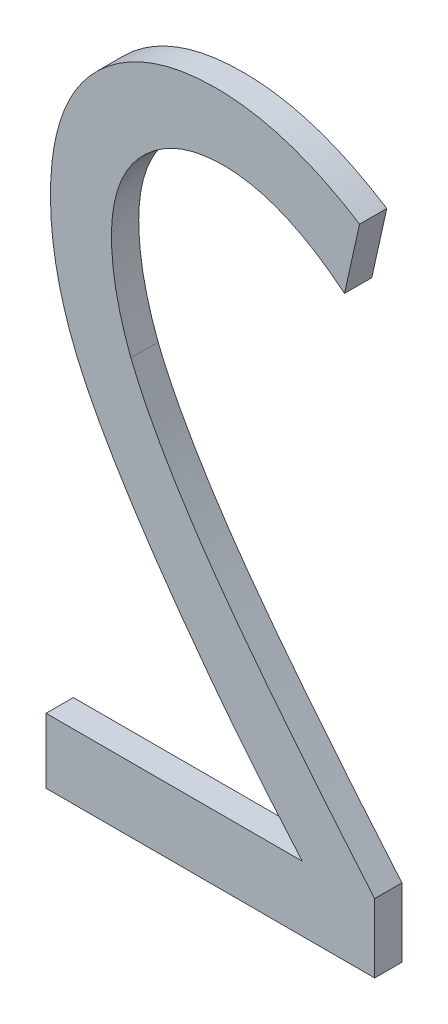
ISO-10303-21;
HEADER;
FILE_DESCRIPTION(('STEP AP214'),'2;1');
FILE_NAME('part.step','',(''),(''),'','','');
FILE_SCHEMA(('AUTOMOTIVE_DESIGN { 1 0 10303 214 1 1 1 1 }'));
ENDSEC;
DATA;
#1=APPLICATION_CONTEXT('core data for automotive mechanical design processes');
#2=APPLICATION_PROTOCOL_DEFINITION('international standard','automotive_design',2000,#1);
#3=PRODUCT_CONTEXT('',#1,'mechanical');
#4=PRODUCT('Part','Part','',(#3));
#5=PRODUCT_RELATED_PRODUCT_CATEGORY('part','',(#4));
#6=PRODUCT_DEFINITION_FORMATION('','',#4);
#7=PRODUCT_DEFINITION_CONTEXT('part definition',#1,'design');
#8=PRODUCT_DEFINITION('design','',#6,#7);
#9=PRODUCT_DEFINITION_SHAPE('','',#8);
#10=(LENGTH_UNIT() NAMED_UNIT(*) SI_UNIT(.MILLI.,.METRE.));
#11=(NAMED_UNIT(*) PLANE_ANGLE_UNIT() SI_UNIT($,.RADIAN.));
#12=(NAMED_UNIT(*) SI_UNIT($,.STERADIAN.) SOLID_ANGLE_UNIT());
#13=UNCERTAINTY_MEASURE_WITH_UNIT(LENGTH_MEASURE(1.E-05),#10,'distance_accuracy_value','');
#14=(GEOMETRIC_REPRESENTATION_CONTEXT(3) GLOBAL_UNCERTAINTY_ASSIGNED_CONTEXT((#13)) GLOBAL_UNIT_ASSIGNED_CONTEXT((#10,
#11,#12)) REPRESENTATION_CONTEXT('',''));
#15=CARTESIAN_POINT('',(0.,0.,0.));
#16=DIRECTION('',(0.,0.,1.));
#17=DIRECTION('',(1.,0.,0.));
#18=AXIS2_PLACEMENT_3D('',#15,#16,#17);
#19=CARTESIAN_POINT('',(179.363036712927,125.948278329335,-39.));
#20=DIRECTION('',(0.,0.,1.));
#21=DIRECTION('',(1.,0.,0.));
#22=AXIS2_PLACEMENT_3D('',#19,#20,#21);
#23=PLANE('',#22);
#24=DIRECTION('',(1.,0.,0.));
#25=VECTOR('',#24,1.);
#26=CARTESIAN_POINT('',(179.363036712927,125.152214694954,-39.));
#27=LINE('',#26,#25);
#28=CARTESIAN_POINT('',(179.715277560368,125.152214694954,-39.));
#29=VERTEX_POINT('',#28);
#30=CARTESIAN_POINT('',(178.775734458008,125.152214694954,-39.));
#31=VERTEX_POINT('',#30);
#32=EDGE_CURVE('E128',#29,#31,#27,.F.);
#33=ORIENTED_EDGE('',*,*,#32,.T.);
#34=DIRECTION('',(0.,1.,0.));
#35=VECTOR('',#34,1.);
#36=CARTESIAN_POINT('',(178.775734458008,125.948278329335,-39.));
#37=LINE('',#36,#35);
#38=CARTESIAN_POINT('',(178.775734458008,124.913993413852,-39.));
#39=VERTEX_POINT('',#38);
#40=EDGE_CURVE('E108',#31,#39,#37,.F.);
#41=ORIENTED_EDGE('',*,*,#40,.T.);
#42=DIRECTION('',(1.,0.,0.));
#43=VECTOR('',#42,1.);
#44=CARTESIAN_POINT('',(179.363036712927,124.913993413852,-39.));
#45=LINE('',#44,#43);
#46=CARTESIAN_POINT('',(179.98083353664,124.913993413852,-39.));
#47=VERTEX_POINT('',#46);
#48=EDGE_CURVE('E104',#39,#47,#45,.T.);
#49=ORIENTED_EDGE('',*,*,#48,.T.);
#50=DIRECTION('',(0.,1.,0.));
#51=VECTOR('',#50,1.);
#52=CARTESIAN_POINT('',(179.98083353664,124.913993413852,-39.));
#53=LINE('',#52,#51);
#54=CARTESIAN_POINT('',(179.98083353664,125.166110936351,-39.));
#55=VERTEX_POINT('',#54);
#56=EDGE_CURVE('E102',#55,#47,#53,.F.);
#57=ORIENTED_EDGE('',*,*,#56,.F.);
#58=CARTESIAN_POINT('',(179.086727768623,126.436624435557,-39.));
#59=CARTESIAN_POINT('',(179.092888818387,126.421132313016,-39.));
#60=CARTESIAN_POINT('',(179.099348113706,126.405762428981,-39.));
#61=CARTESIAN_POINT('',(179.112776282606,126.375247302634,-39.));
#62=CARTESIAN_POINT('',(179.119745130022,126.360102048836,-39.));
#63=CARTESIAN_POINT('',(179.134105901526,126.3300152623,-39.));
#64=CARTESIAN_POINT('',(179.141497811536,126.315073722804,-39.));
#65=CARTESIAN_POINT('',(179.156644408297,126.285376729993,-39.));
#66=CARTESIAN_POINT('',(179.164399086915,126.270621272514,-39.));
#67=CARTESIAN_POINT('',(179.188134300099,126.226603293513,-39.));
#68=CARTESIAN_POINT('',(179.204584155622,126.197592989437,-39.));
#69=CARTESIAN_POINT('',(179.229980422469,126.154512475278,-39.));
#70=CARTESIAN_POINT('',(179.238565365378,126.140225937032,-39.));
#71=CARTESIAN_POINT('',(179.264647660254,126.097562698147,-39.));
#72=CARTESIAN_POINT('',(179.282471336021,126.069384376933,-39.));
#73=CARTESIAN_POINT('',(179.309726506305,126.027460170251,-39.));
#74=CARTESIAN_POINT('',(179.318897777582,126.013543222797,-39.));
#75=CARTESIAN_POINT('',(179.346670097442,125.971961757683,-39.));
#76=CARTESIAN_POINT('',(179.365528629747,125.944468232993,-39.));
#77=CARTESIAN_POINT('',(179.403880050266,125.889930433792,-39.));
#78=CARTESIAN_POINT('',(179.423372922731,125.862886148153,-39.));
#79=CARTESIAN_POINT('',(179.462797418602,125.809121395734,-39.));
#80=CARTESIAN_POINT('',(179.482729032694,125.782400922097,-39.));
#81=CARTESIAN_POINT('',(179.522945512241,125.729228009605,-39.));
#82=CARTESIAN_POINT('',(179.543230373816,125.70277556781,-39.));
#83=CARTESIAN_POINT('',(179.584083147597,125.650090768106,-39.));
#84=CARTESIAN_POINT('',(179.604651058036,125.623858408825,-39.));
#85=CARTESIAN_POINT('',(179.646022863837,125.571580851571,-39.));
#86=CARTESIAN_POINT('',(179.666826758301,125.545535652887,-39.));
#87=CARTESIAN_POINT('',(179.729536989084,125.467638921907,-39.));
#88=CARTESIAN_POINT('',(179.771741239735,125.416027066146,-39.));
#89=CARTESIAN_POINT('',(179.83549269295,125.338980235817,-39.));
#90=CARTESIAN_POINT('',(179.856817134012,125.31336004769,-39.));
#91=CARTESIAN_POINT('',(179.912258549975,125.247101268435,-39.));
#92=CARTESIAN_POINT('',(179.946477494292,125.206547984025,-39.));
#93=CARTESIAN_POINT('',(179.98083353664,125.166110936351,-39.));
#94=B_SPLINE_CURVE_WITH_KNOTS('',3,(#58,#59,#60,#61,#62,#63,#64,#65,#66,#67,#68,#69,#70,#71,#72,
#73,#74,#75,#76,#77,#78,#79,#80,#81,#82,#83,#84,#85,#86,#87,#88,#89,#90,#91,#92,#93),
.UNSPECIFIED.,.F.,.F.,(4,2,2,2,2,2,2,2,2,2,2,2,2,2,2,2,2,4),(0.,0.0500087757287242,
0.100014985312846,0.15001953180807,0.200022957623838,0.300042550380375,0.350044224301037,
0.450054488447363,0.500055433134775,0.600063057038982,0.700068199814345,0.800071221646829,
0.900073145683874,1.00007444573218,1.10007536526152,1.30008029152964,1.40008068587399,
1.55926333786803),.UNSPECIFIED.);
#95=CARTESIAN_POINT('',(179.086727768623,126.436624435557,-39.));
#96=VERTEX_POINT('',#95);
#97=EDGE_CURVE('E24',#96,#55,#94,.T.);
#98=ORIENTED_EDGE('',*,*,#97,.F.);
#99=CARTESIAN_POINT('',(179.870269356405,127.032839364091,-39.));
#100=CARTESIAN_POINT('',(179.844464604507,127.053892125233,-39.));
#101=CARTESIAN_POINT('',(179.817778702732,127.074000949937,-39.));
#102=CARTESIAN_POINT('',(179.76223301318,127.111647626545,-39.));
#103=CARTESIAN_POINT('',(179.733352399875,127.129154494778,-39.));
#104=CARTESIAN_POINT('',(179.673420875205,127.16048662411,-39.));
#105=CARTESIAN_POINT('',(179.642359660831,127.17429268314,-39.));
#106=CARTESIAN_POINT('',(179.578493558742,127.196769154013,-39.));
#107=CARTESIAN_POINT('',(179.545696659129,127.205461184089,-39.));
#108=CARTESIAN_POINT('',(179.499022545459,127.213244571093,-39.));
#109=CARTESIAN_POINT('',(179.485560751104,127.214968783175,-39.));
#110=CARTESIAN_POINT('',(179.458537604108,127.217341189161,-39.));
#111=CARTESIAN_POINT('',(179.444976236531,127.217989218195,-39.));
#112=CARTESIAN_POINT('',(179.417837304214,127.218225631912,-39.));
#113=CARTESIAN_POINT('',(179.404259734666,127.217813431986,-39.));
#114=CARTESIAN_POINT('',(179.377184572427,127.215908870563,-39.));
#115=CARTESIAN_POINT('',(179.363686961864,127.214416760413,-39.));
#116=CARTESIAN_POINT('',(179.328392913601,127.208876445988,-39.));
#117=CARTESIAN_POINT('',(179.306740715869,127.203808940999,-39.));
#118=CARTESIAN_POINT('',(179.264633528884,127.190100637508,-39.));
#119=CARTESIAN_POINT('',(179.244176235518,127.181466993905,-39.));
#120=CARTESIAN_POINT('',(179.205070125526,127.160663213691,-39.));
#121=CARTESIAN_POINT('',(179.186425440672,127.148485238908,-39.));
#122=CARTESIAN_POINT('',(179.160245051793,127.127964627676,-39.));
#123=CARTESIAN_POINT('',(179.151805894205,127.120737580784,-39.));
#124=CARTESIAN_POINT('',(179.1355232211,127.105636316063,-39.));
#125=CARTESIAN_POINT('',(179.127679754215,127.097762045503,-39.));
#126=CARTESIAN_POINT('',(179.112694608627,127.081401713745,-39.));
#127=CARTESIAN_POINT('',(179.105551353495,127.072917105028,-39.));
#128=CARTESIAN_POINT('',(179.092075219275,127.055332912896,-39.));
#129=CARTESIAN_POINT('',(179.085742090355,127.046233520402,-39.));
#130=CARTESIAN_POINT('',(179.068045514759,127.018179588419,-39.));
#131=CARTESIAN_POINT('',(179.057936612147,126.998416641935,-39.));
#132=CARTESIAN_POINT('',(179.039836948045,126.954227978385,-39.));
#133=CARTESIAN_POINT('',(179.03244467416,126.92956239722,-39.));
#134=CARTESIAN_POINT('',(179.021725551154,126.879305951644,-39.));
#135=CARTESIAN_POINT('',(179.018415240848,126.853711752754,-39.));
#136=CARTESIAN_POINT('',(179.015428569213,126.806551172576,-39.));
#137=CARTESIAN_POINT('',(179.015246881135,126.785009869474,-39.));
#138=CARTESIAN_POINT('',(179.016609678626,126.741972564922,-39.));
#139=CARTESIAN_POINT('',(179.018155574674,126.720476614866,-39.));
#140=CARTESIAN_POINT('',(179.022861689933,126.677627307792,-39.));
#141=CARTESIAN_POINT('',(179.026024631793,126.656274252998,-39.));
#142=CARTESIAN_POINT('',(179.033793055478,126.613847555167,-39.));
#143=CARTESIAN_POINT('',(179.038397790889,126.592773773422,-39.));
#144=CARTESIAN_POINT('',(179.049424973154,126.548827276362,-39.));
#145=CARTESIAN_POINT('',(179.055984560891,126.525989308047,-39.));
#146=CARTESIAN_POINT('',(179.070419035425,126.480899623099,-39.));
#147=CARTESIAN_POINT('',(179.078284824098,126.458645005543,-39.));
#148=CARTESIAN_POINT('',(179.086727768623,126.436624435557,-39.));
#149=B_SPLINE_CURVE_WITH_KNOTS('',3,(#99,#100,#101,#102,#103,#104,#105,#106,#107,#108,#109,#110,
#111,#112,#113,#114,#115,#116,#117,#118,#119,#120,#121,#122,#123,#124,#125,#126,#127,#128,#129,
#130,#131,#132,#133,#134,#135,#136,#137,#138,#139,#140,#141,#142,#143,#144,#145,#146,#147,#148),
.UNSPECIFIED.,.F.,.F.,(4,2,2,2,2,2,2,2,2,2,2,2,2,2,2,2,2,2,2,2,2,2,2,2,4),(0.,0.100017091060496,
0.20114331978785,0.302784519930555,0.403992912424035,0.444673257895479,0.485359834993945,
0.526068851491836,0.56676839611547,0.63317996550767,0.699458932732076,0.765885602127951,
0.799188569711322,0.832494253265985,0.865723143215523,0.898941760981254,0.965167907700774,
1.04200009693,1.11914257357676,1.1836822873536,1.24827473282316,1.31297629366081,
1.37764441378542,1.44888237926588,1.51964349919607),.UNSPECIFIED.);
#150=CARTESIAN_POINT('',(179.870269356405,127.032839364091,-39.));
#151=VERTEX_POINT('',#150);
#152=EDGE_CURVE('E89',#151,#96,#149,.T.);
#153=ORIENTED_EDGE('',*,*,#152,.F.);
#154=DIRECTION('',(0.217054100601005,0.976159575792959,0.));
#155=VECTOR('',#154,1.);
#156=CARTESIAN_POINT('',(179.870269356405,127.032839364091,-39.));
#157=LINE('',#156,#155);
#158=CARTESIAN_POINT('',(179.925299016887,127.280324806124,-39.));
#159=VERTEX_POINT('',#158);
#160=EDGE_CURVE('E125',#159,#151,#157,.F.);
#161=ORIENTED_EDGE('',*,*,#160,.F.);
#162=CARTESIAN_POINT('',(179.715277560368,125.152214694954,-39.));
#163=CARTESIAN_POINT('',(179.693397723106,125.177352437158,-39.));
#164=CARTESIAN_POINT('',(179.671644203359,125.202599393354,-39.));
#165=CARTESIAN_POINT('',(179.628403526617,125.253346808572,-39.));
#166=CARTESIAN_POINT('',(179.606916539625,125.278847412402,-39.));
#167=CARTESIAN_POINT('',(179.542831864208,125.355837055005,-39.));
#168=CARTESIAN_POINT('',(179.500696735449,125.407715208436,-39.));
#169=CARTESIAN_POINT('',(179.41810739078,125.512802634338,-39.));
#170=CARTESIAN_POINT('',(179.377653432099,125.566012108527,-39.));
#171=CARTESIAN_POINT('',(179.297966316515,125.673272051005,-39.));
#172=CARTESIAN_POINT('',(179.25873226028,125.727321853466,-39.));
#173=CARTESIAN_POINT('',(179.181931718363,125.836590482849,-39.));
#174=CARTESIAN_POINT('',(179.144364948199,125.891809107946,-39.));
#175=CARTESIAN_POINT('',(179.082012780656,125.987709087949,-39.));
#176=CARTESIAN_POINT('',(179.056653266519,126.02801472736,-39.));
#177=CARTESIAN_POINT('',(179.019826459179,126.089258759104,-39.));
#178=CARTESIAN_POINT('',(179.007741368962,126.109825488198,-39.));
#179=CARTESIAN_POINT('',(178.984066433683,126.151254066613,-39.));
#180=CARTESIAN_POINT('',(178.972476784785,126.172116028556,-39.));
#181=CARTESIAN_POINT('',(178.950864946989,126.212411939061,-39.));
#182=CARTESIAN_POINT('',(178.940792798842,126.231819018601,-39.));
#183=CARTESIAN_POINT('',(178.921287097288,126.270952836367,-39.));
#184=CARTESIAN_POINT('',(178.911853517632,126.290679561414,-39.));
#185=CARTESIAN_POINT('',(178.893864510446,126.330528332224,-39.));
#186=CARTESIAN_POINT('',(178.8853088888,126.350650289425,-39.));
#187=CARTESIAN_POINT('',(178.869214406658,126.391295204578,-39.));
#188=CARTESIAN_POINT('',(178.861675551838,126.411818164769,-39.));
#189=CARTESIAN_POINT('',(178.840703993007,126.473796303652,-39.));
#190=CARTESIAN_POINT('',(178.828851395187,126.515802675121,-39.));
#191=CARTESIAN_POINT('',(178.809880166121,126.600863530484,-39.));
#192=CARTESIAN_POINT('',(178.802760051099,126.643917681475,-39.));
#193=CARTESIAN_POINT('',(178.793236974023,126.733481552714,-39.));
#194=CARTESIAN_POINT('',(178.791184753638,126.78002840288,-39.));
#195=CARTESIAN_POINT('',(178.793004369259,126.87310226004,-39.));
#196=CARTESIAN_POINT('',(178.796879334006,126.919629243576,-39.));
#197=CARTESIAN_POINT('',(178.81060289395,126.999095193341,-39.));
#198=CARTESIAN_POINT('',(178.818577264796,127.032341061517,-39.));
#199=CARTESIAN_POINT('',(178.839695079947,127.097086364679,-39.));
#200=CARTESIAN_POINT('',(178.852821676671,127.12859111382,-39.));
#201=CARTESIAN_POINT('',(178.884949702838,127.188983979123,-39.));
#202=CARTESIAN_POINT('',(178.904014471155,127.217839319992,-39.));
#203=CARTESIAN_POINT('',(178.936660650627,127.257792320831,-39.));
#204=CARTESIAN_POINT('',(178.948235954143,127.270570001374,-39.));
#205=CARTESIAN_POINT('',(178.972600579301,127.294911409495,-39.));
#206=CARTESIAN_POINT('',(178.98539013326,127.306474903873,-39.));
#207=CARTESIAN_POINT('',(179.021472764108,127.336203641336,-39.));
#208=CARTESIAN_POINT('',(179.045750909204,127.353194685371,-39.));
#209=CARTESIAN_POINT('',(179.096746112654,127.382992521343,-39.));
#210=CARTESIAN_POINT('',(179.12346259553,127.39580029733,-39.));
#211=CARTESIAN_POINT('',(179.165430730665,127.412072707861,-39.));
#212=CARTESIAN_POINT('',(179.180105335771,127.417086607056,-39.));
#213=CARTESIAN_POINT('',(179.209785644807,127.425971632875,-39.));
#214=CARTESIAN_POINT('',(179.224791070806,127.429843682218,-39.));
#215=CARTESIAN_POINT('',(179.255059431867,127.436506777138,-39.));
#216=CARTESIAN_POINT('',(179.270322698185,127.439296300942,-39.));
#217=CARTESIAN_POINT('',(179.301005510346,127.443853768477,-39.));
#218=CARTESIAN_POINT('',(179.316425126355,127.445621230833,-39.));
#219=CARTESIAN_POINT('',(179.354776366606,127.448853705655,-39.));
#220=CARTESIAN_POINT('',(179.377755744024,127.449764858281,-39.));
#221=CARTESIAN_POINT('',(179.42370746295,127.449688055442,-39.));
#222=CARTESIAN_POINT('',(179.446679803419,127.448699893226,-39.));
#223=CARTESIAN_POINT('',(179.515461272272,127.442778122788,-39.));
#224=CARTESIAN_POINT('',(179.561038259221,127.434879051073,-39.));
#225=CARTESIAN_POINT('',(179.662738603863,127.409022693598,-39.));
#226=CARTESIAN_POINT('',(179.718297906114,127.388889899008,-39.));
#227=CARTESIAN_POINT('',(179.798412540581,127.352364040463,-39.));
#228=CARTESIAN_POINT('',(179.824519410935,127.339174678222,-39.));
#229=CARTESIAN_POINT('',(179.875676499252,127.311014787855,-39.));
#230=CARTESIAN_POINT('',(179.900729094949,127.296048594945,-39.));
#231=CARTESIAN_POINT('',(179.925299016887,127.280324806124,-39.));
#232=B_SPLINE_CURVE_WITH_KNOTS('',3,(#162,#163,#164,#165,#166,#167,#168,#169,#170,#171,#172,
#173,#174,#175,#176,#177,#178,#179,#180,#181,#182,#183,#184,#185,#186,#187,#188,#189,#190,#191,
#192,#193,#194,#195,#196,#197,#198,#199,#200,#201,#202,#203,#204,#205,#206,#207,#208,#209,#210,
#211,#212,#213,#214,#215,#216,#217,#218,#219,#220,#221,#222,#223,#224,#225,#226,#227,#228,#229,
#230,#231),.UNSPECIFIED.,.F.,.F.,(4,2,2,2,2,2,2,2,2,2,2,2,2,2,2,2,2,2,2,2,2,2,2,2,2,2,2,2,2,2,2,
2,2,2,4),(0.,0.0999767718294698,0.200014333832938,0.400482694365106,0.600981615675574,
0.801329041651482,1.00164215072499,1.14446996126362,1.21602823502701,1.28761458405416,
1.35320079741041,1.41878431310224,1.48435329691105,1.54992264675621,1.68059526903083,
1.81122690217361,1.95067370479288,2.09019414161808,2.19241019688116,2.29429475748367,
2.39730559425314,2.44895088202891,2.50060607088424,2.58910563433554,2.677584364565,
2.72406792285531,2.77051381463421,2.81702476375678,2.86355760104136,2.93246017383218,
3.00137024746995,3.13947724549415,3.31572993405268,3.403423555846,3.4909074523921),.UNSPECIFIED.);
#233=EDGE_CURVE('E173',#29,#159,#232,.T.);
#234=ORIENTED_EDGE('',*,*,#233,.F.);
#235=EDGE_LOOP('',(#33,#41,#49,#57,#98,#153,#161,#234));
#236=FACE_BOUND('',#235,.T.);
#237=ADVANCED_FACE('F17',(#236),#23,.T.);
#238=CARTESIAN_POINT('',(179.98083353664,124.913993413852,-39.1));
#239=DIRECTION('',(1.,0.,0.));
#240=DIRECTION('',(0.,0.,-1.));
#241=AXIS2_PLACEMENT_3D('',#238,#239,#240);
#242=PLANE('',#241);
#243=DIRECTION('',(0.,1.,0.));
#244=VECTOR('',#243,1.);
#245=CARTESIAN_POINT('',(179.98083353664,125.948278329335,-39.1));
#246=LINE('',#245,#244);
#247=CARTESIAN_POINT('',(179.98083353664,124.913993413852,-39.1));
#248=VERTEX_POINT('',#247);
#249=CARTESIAN_POINT('',(179.98083353664,125.166110936351,-39.1));
#250=VERTEX_POINT('',#249);
#251=EDGE_CURVE('E112',#248,#250,#246,.T.);
#252=ORIENTED_EDGE('',*,*,#251,.T.);
#253=DIRECTION('',(0.,0.,-1.));
#254=VECTOR('',#253,1.);
#255=CARTESIAN_POINT('',(179.98083353664,125.166110936351,-39.05));
#256=LINE('',#255,#254);
#257=EDGE_CURVE('E98',#55,#250,#256,.T.);
#258=ORIENTED_EDGE('',*,*,#257,.F.);
#259=ORIENTED_EDGE('',*,*,#56,.T.);
#260=DIRECTION('',(0.,0.,-1.));
#261=VECTOR('',#260,1.);
#262=CARTESIAN_POINT('',(179.98083353664,124.913993413852,-39.1));
#263=LINE('',#262,#261);
#264=EDGE_CURVE('E117',#248,#47,#263,.F.);
#265=ORIENTED_EDGE('',*,*,#264,.F.);
#266=EDGE_LOOP('',(#252,#258,#259,#265));
#267=FACE_BOUND('',#266,.T.);
#268=ADVANCED_FACE('F111',(#267),#242,.T.);
#269=CARTESIAN_POINT('',(179.98083353664,125.166110936351,-39.1));
#270=CARTESIAN_POINT('',(179.98083353664,125.166110936351,-39.));
#271=CARTESIAN_POINT('',(179.689024878303,125.509546616605,-39.1));
#272=CARTESIAN_POINT('',(179.689024878303,125.509546616605,-39.));
#273=CARTESIAN_POINT('',(179.476479125432,125.780192460967,-39.1));
#274=CARTESIAN_POINT('',(179.476479125432,125.780192460967,-39.));
#275=CARTESIAN_POINT('',(179.222084953364,126.15641099938,-39.1));
#276=CARTESIAN_POINT('',(179.222084953364,126.15641099938,-39.));
#277=CARTESIAN_POINT('',(179.137213695671,126.309573085637,-39.1));
#278=CARTESIAN_POINT('',(179.137213695671,126.309573085637,-39.));
#279=CARTESIAN_POINT('',(179.086727768623,126.436624435557,-39.1));
#280=CARTESIAN_POINT('',(179.086727768623,126.436624435557,-39.));
#281=B_SPLINE_SURFACE_WITH_KNOTS('',3,1,((#269,#270),(#271,#272),(#273,#274),(#275,#276),(#277,
#278),(#279,#280)),.UNSPECIFIED.,.F.,.F.,.F.,(4,2,4),(2,2),(0.,0.525907121177182,1.),(1.,1.1),.UNSPECIFIED.);
#282=CARTESIAN_POINT('',(179.98083353664,125.166110936351,-39.1));
#283=CARTESIAN_POINT('',(179.959250511314,125.191513419227,-39.1));
#284=CARTESIAN_POINT('',(179.937721811115,125.216962250277,-39.1));
#285=CARTESIAN_POINT('',(179.894788236192,125.267964156109,-39.1));
#286=CARTESIAN_POINT('',(179.873383361545,125.293517230956,-39.1));
#287=CARTESIAN_POINT('',(179.841380343857,125.331933634558,-39.1));
#288=CARTESIAN_POINT('',(179.830730065366,125.344753553456,-39.1));
#289=CARTESIAN_POINT('',(179.79883469711,125.38325948921,-39.1));
#290=CARTESIAN_POINT('',(179.777645151503,125.408991593318,-39.1));
#291=CARTESIAN_POINT('',(179.74598815228,125.447693752213,-39.1));
#292=CARTESIAN_POINT('',(179.735457055478,125.460611785303,-39.1));
#293=CARTESIAN_POINT('',(179.714440591627,125.486484993364,-39.1));
#294=CARTESIAN_POINT('',(179.703955224588,125.499440168343,-39.1));
#295=CARTESIAN_POINT('',(179.672572712846,125.538365440216,-39.1));
#296=CARTESIAN_POINT('',(179.651749292444,125.564395119262,-39.1));
#297=CARTESIAN_POINT('',(179.620688447401,125.603577551715,-39.1));
#298=CARTESIAN_POINT('',(179.610363907612,125.616661312678,-39.1));
#299=CARTESIAN_POINT('',(179.589778465579,125.64287884194,-39.1));
#300=CARTESIAN_POINT('',(179.579517563366,125.656012610264,-39.1));
#301=CARTESIAN_POINT('',(179.559065733498,125.682334544677,-39.1));
#302=CARTESIAN_POINT('',(179.548874805887,125.695522710801,-39.1));
#303=CARTESIAN_POINT('',(179.528570426219,125.721958591561,-39.1));
#304=CARTESIAN_POINT('',(179.518456974226,125.735206306246,-39.1));
#305=CARTESIAN_POINT('',(179.498316437431,125.761767281336,-39.1));
#306=CARTESIAN_POINT('',(179.488289352725,125.775080541813,-39.1));
#307=CARTESIAN_POINT('',(179.468332336457,125.801779752349,-39.1));
#308=CARTESIAN_POINT('',(179.458402405038,125.815165702517,-39.1));
#309=CARTESIAN_POINT('',(179.438652594606,125.842018656015,-39.1));
#310=CARTESIAN_POINT('',(179.428832715817,125.855485659511,-39.1));
#311=CARTESIAN_POINT('',(179.409320077132,125.882511554603,-39.1));
#312=CARTESIAN_POINT('',(179.399627317603,125.896070446465,-39.1));
#313=CARTESIAN_POINT('',(179.380386634783,125.923290901017,-39.1));
#314=CARTESIAN_POINT('',(179.370838712104,125.936952464142,-39.1));
#315=CARTESIAN_POINT('',(179.351925357896,125.964401450942,-39.1));
#316=CARTESIAN_POINT('',(179.34255992731,125.978188875267,-39.1));
#317=CARTESIAN_POINT('',(179.32399098499,126.005872234078,-39.1));
#318=CARTESIAN_POINT('',(179.314787472575,126.019768168108,-39.1));
#319=CARTESIAN_POINT('',(179.301111568365,126.040696336037,-39.1));
#320=CARTESIAN_POINT('',(179.296574521913,126.047686393177,-39.1));
#321=CARTESIAN_POINT('',(179.283031531258,126.068701001598,-39.1));
#322=CARTESIAN_POINT('',(179.274093897071,126.082769746585,-39.1));
#323=CARTESIAN_POINT('',(179.260838693298,126.103967088467,-39.1));
#324=CARTESIAN_POINT('',(179.256445534331,126.111048516411,-39.1));
#325=CARTESIAN_POINT('',(179.247712428384,126.125244103805,-39.1));
#326=CARTESIAN_POINT('',(179.243372481441,126.132358263278,-39.1));
#327=CARTESIAN_POINT('',(179.230436523491,126.153752216135,-39.1));
#328=CARTESIAN_POINT('',(179.221924626229,126.168083115382,-39.1));
#329=CARTESIAN_POINT('',(179.209346337459,126.1896892849,-39.1));
#330=CARTESIAN_POINT('',(179.205185214894,126.196909559856,-39.1));
#331=CARTESIAN_POINT('',(179.196930123114,126.211388474837,-39.1));
#332=CARTESIAN_POINT('',(179.19283615398,126.218647114908,-39.1));
#333=CARTESIAN_POINT('',(179.184719898578,126.233204308702,-39.1));
#334=CARTESIAN_POINT('',(179.18069761241,126.24050286248,-39.1));
#335=CARTESIAN_POINT('',(179.168744911517,126.262462016431,-39.1));
#336=CARTESIAN_POINT('',(179.160929044362,126.277185427135,-39.1));
#337=CARTESIAN_POINT('',(179.149470285057,126.299406347226,-39.1));
#338=CARTESIAN_POINT('',(179.145694947073,126.306835800485,-39.1));
#339=CARTESIAN_POINT('',(179.138239579871,126.321742488232,-39.1));
#340=CARTESIAN_POINT('',(179.134559550926,126.329219722856,-39.1));
#341=CARTESIAN_POINT('',(179.127302693884,126.34422416894,-39.1));
#342=CARTESIAN_POINT('',(179.123725866145,126.351751380574,-39.1));
#343=CARTESIAN_POINT('',(179.11668446032,126.366858212728,-39.1));
#344=CARTESIAN_POINT('',(179.113219882708,126.37443783347,-39.1));
#345=CARTESIAN_POINT('',(179.106413147836,126.389651983016,-39.1));
#346=CARTESIAN_POINT('',(179.103070991216,126.397286512107,-39.1));
#347=CARTESIAN_POINT('',(179.095308118769,126.415452749111,-39.1));
#348=CARTESIAN_POINT('',(179.090946628542,126.426009763201,-39.1));
#349=CARTESIAN_POINT('',(179.086727768623,126.436624435557,-39.1));
#350=B_SPLINE_CURVE_WITH_KNOTS('',3,(#282,#283,#284,#285,#286,#287,#288,#289,#290,#291,#292,
#293,#294,#295,#296,#297,#298,#299,#300,#301,#302,#303,#304,#305,#306,#307,#308,#309,#310,#311,
#312,#313,#314,#315,#316,#317,#318,#319,#320,#321,#322,#323,#324,#325,#326,#327,#328,#329,#330,
#331,#332,#333,#334,#335,#336,#337,#338,#339,#340,#341,#342,#343,#344,#345,#346,#347,#348,#349),
.UNSPECIFIED.,.F.,.F.,(4,2,2,2,2,2,2,2,2,2,2,2,2,2,2,2,2,2,2,2,2,2,2,2,2,2,2,2,2,2,2,2,2,4),(0.,
0.100000254559566,0.200000571502397,0.250000619652457,0.350001075307999,0.400001146389994,
0.450001228333043,0.55000203114569,0.60000216263034,0.650002319417765,0.700002508458083,
0.750002739259363,0.800003025103878,0.850003384993666,0.900003846872015,0.95000445316854,
1.00000527079352,1.05000634658728,1.10000721193614,1.12500733661942,1.17500846167302,
1.20000862614621,1.225008807697,1.27501047539727,1.30001072513165,1.32501100520872,
1.35001132079557,1.40001430863964,1.42501477479501,1.45001531215095,1.47501593588345,
1.50001666534681,1.52501752549386,1.55928215406864),.UNSPECIFIED.);
#351=CARTESIAN_POINT('',(179.086727768623,126.436624435557,-39.1));
#352=VERTEX_POINT('',#351);
#353=EDGE_CURVE('E167',#250,#352,#350,.T.);
#354=DIRECTION('',(0.,0.,-1.));
#355=VECTOR('',#354,1.);
#356=CARTESIAN_POINT('',(179.086727768623,126.436624435557,-39.05));
#357=LINE('',#356,#355);
#358=EDGE_CURVE('E100',#96,#352,#357,.T.);
#359=ORIENTED_EDGE('',*,*,#353,.T.);
#360=ORIENTED_EDGE('',*,*,#358,.F.);
#361=ORIENTED_EDGE('',*,*,#97,.T.);
#362=ORIENTED_EDGE('',*,*,#257,.T.);
#363=EDGE_LOOP('',(#359,#360,#361,#362));
#364=FACE_BOUND('',#363,.T.);
#365=ADVANCED_FACE('F96',(#364),#281,.T.);
#366=CARTESIAN_POINT('',(179.086727768623,126.436624435557,-39.1));
#367=CARTESIAN_POINT('',(179.086727768623,126.436624435557,-39.));
#368=CARTESIAN_POINT('',(179.039270997198,126.560367156574,-39.1));
#369=CARTESIAN_POINT('',(179.039270997198,126.560367156574,-39.));
#370=CARTESIAN_POINT('',(179.015542611485,126.677492619782,-39.1));
#371=CARTESIAN_POINT('',(179.015542611485,126.677492619782,-39.));
#372=CARTESIAN_POINT('',(179.015542611485,126.91372872354,-39.1));
#373=CARTESIAN_POINT('',(179.015542611485,126.91372872354,-39.));
#374=CARTESIAN_POINT('',(179.050882760419,127.014972768008,-39.1));
#375=CARTESIAN_POINT('',(179.050882760419,127.014972768008,-39.));
#376=CARTESIAN_POINT('',(179.200040423831,127.175564468112,-39.1));
#377=CARTESIAN_POINT('',(179.200040423831,127.175564468112,-39.));
#378=CARTESIAN_POINT('',(179.301797817847,127.218122582725,-39.1));
#379=CARTESIAN_POINT('',(179.301797817847,127.218122582725,-39.));
#380=CARTESIAN_POINT('',(179.570887809012,127.218122582725,-39.1));
#381=CARTESIAN_POINT('',(179.570887809012,127.218122582725,-39.));
#382=CARTESIAN_POINT('',(179.718811575262,127.156582085107,-39.1));
#383=CARTESIAN_POINT('',(179.718811575262,127.156582085107,-39.));
#384=CARTESIAN_POINT('',(179.870269356405,127.032839364091,-39.1));
#385=CARTESIAN_POINT('',(179.870269356405,127.032839364091,-39.));
#386=B_SPLINE_SURFACE_WITH_KNOTS('',3,1,((#366,#367),(#368,#369),(#370,#371),(#372,#373),(#374,
#375),(#376,#377),(#378,#379),(#380,#381),(#382,#383),(#384,#385)),.UNSPECIFIED.,.F.,.F.,.F.,(4,
2,2,2,4),(2,2),(0.,0.206536823199461,0.441518837618003,0.702422795278628,1.),(1.,1.1),.UNSPECIFIED.);
#387=CARTESIAN_POINT('',(179.086727768623,126.436624435557,-39.1));
#388=CARTESIAN_POINT('',(179.074867480558,126.467591222721,-39.1));
#389=CARTESIAN_POINT('',(179.064129232876,126.499022059179,-39.1));
#390=CARTESIAN_POINT('',(179.045287690572,126.563315623003,-39.1));
#391=CARTESIAN_POINT('',(179.037239254756,126.596194278501,-39.1));
#392=CARTESIAN_POINT('',(179.022624425191,126.673515447798,-39.1));
#393=CARTESIAN_POINT('',(179.017395360795,126.718235286101,-39.1));
#394=CARTESIAN_POINT('',(179.015219830618,126.785328941896,-39.1));
#395=CARTESIAN_POINT('',(179.015429306674,126.80762145031,-39.1));
#396=CARTESIAN_POINT('',(179.018382059446,126.852025149074,-39.1));
#397=CARTESIAN_POINT('',(179.021120475451,126.874136605189,-39.1));
#398=CARTESIAN_POINT('',(179.029641168151,126.917993665188,-39.1));
#399=CARTESIAN_POINT('',(179.035450670234,126.939734171987,-39.1));
#400=CARTESIAN_POINT('',(179.050557748342,126.981970999732,-39.1));
#401=CARTESIAN_POINT('',(179.059849098249,127.002469466093,-39.1));
#402=CARTESIAN_POINT('',(179.076454528477,127.031740122678,-39.1));
#403=CARTESIAN_POINT('',(179.082454522444,127.041274889769,-39.1));
#404=CARTESIAN_POINT('',(179.095305888119,127.059757940472,-39.1));
#405=CARTESIAN_POINT('',(179.10215732193,127.06870618123,-39.1));
#406=CARTESIAN_POINT('',(179.116666855384,127.085949643972,-39.1));
#407=CARTESIAN_POINT('',(179.124326610234,127.094243462767,-39.1));
#408=CARTESIAN_POINT('',(179.140273658677,127.110204842735,-39.1));
#409=CARTESIAN_POINT('',(179.148561057992,127.117872297946,-39.1));
#410=CARTESIAN_POINT('',(179.165427768658,127.13218541286,-39.1));
#411=CARTESIAN_POINT('',(179.173982963725,127.138859317341,-39.1));
#412=CARTESIAN_POINT('',(179.191624913522,127.151452402684,-39.1));
#413=CARTESIAN_POINT('',(179.200711496421,127.15737182557,-39.1));
#414=CARTESIAN_POINT('',(179.228651356702,127.173875472533,-39.1));
#415=CARTESIAN_POINT('',(179.248238584646,127.183251097187,-39.1));
#416=CARTESIAN_POINT('',(179.288352604894,127.198425612609,-39.1));
#417=CARTESIAN_POINT('',(179.308858176398,127.204281757979,-39.1));
#418=CARTESIAN_POINT('',(179.350537134377,127.212877323089,-39.1));
#419=CARTESIAN_POINT('',(179.371712086306,127.215608780202,-39.1));
#420=CARTESIAN_POINT('',(179.42243582105,127.218959946058,-39.1));
#421=CARTESIAN_POINT('',(179.452069454079,127.218361539624,-39.1));
#422=CARTESIAN_POINT('',(179.510764078708,127.212126425145,-39.1));
#423=CARTESIAN_POINT('',(179.539825296795,127.206491752449,-39.1));
#424=CARTESIAN_POINT('',(179.606206483572,127.18835298036,-39.1));
#425=CARTESIAN_POINT('',(179.643063876799,127.174188957104,-39.1));
#426=CARTESIAN_POINT('',(179.714150468699,127.140245987467,-39.1));
#427=CARTESIAN_POINT('',(179.748369512895,127.120446601186,-39.1));
#428=CARTESIAN_POINT('',(179.796699353995,127.088461534642,-39.1));
#429=CARTESIAN_POINT('',(179.81185656916,127.077801264169,-39.1));
#430=CARTESIAN_POINT('',(179.841514422584,127.05580778436,-39.1));
#431=CARTESIAN_POINT('',(179.856018862093,127.04447971211,-39.1));
#432=CARTESIAN_POINT('',(179.870269356405,127.032839364091,-39.1));
#433=B_SPLINE_CURVE_WITH_KNOTS('',3,(#387,#388,#389,#390,#391,#392,#393,#394,#395,#396,#397,
#398,#399,#400,#401,#402,#403,#404,#405,#406,#407,#408,#409,#410,#411,#412,#413,#414,#415,#416,
#417,#418,#419,#420,#421,#422,#423,#424,#425,#426,#427,#428,#429,#430,#431,#432),.UNSPECIFIED.,
.F.,.F.,(4,2,2,2,2,2,2,2,2,2,2,2,2,2,2,2,2,2,2,2,2,2,4),(0.,0.0994993194009797,
0.200919116723399,0.335384102633908,0.402172627955301,0.46883304999778,0.536094583495131,
0.60323641177274,0.636992639629898,0.670751331080548,0.704580543597846,0.738415467131983,
0.770926269764318,0.803426617123252,0.868217703170394,0.931924039781208,0.9957923597657,
1.08425334405215,1.17267859404258,1.29047093347964,1.40869608178094,1.46427050942136,
1.5194624040037),.UNSPECIFIED.);
#434=CARTESIAN_POINT('',(179.870269356405,127.032839364091,-39.1));
#435=VERTEX_POINT('',#434);
#436=EDGE_CURVE('E152',#352,#435,#433,.T.);
#437=DIRECTION('',(0.,0.,1.));
#438=VECTOR('',#437,1.);
#439=CARTESIAN_POINT('',(179.870269356405,127.032839364091,-39.1));
#440=LINE('',#439,#438);
#441=EDGE_CURVE('E127',#151,#435,#440,.F.);
#442=ORIENTED_EDGE('',*,*,#436,.T.);
#443=ORIENTED_EDGE('',*,*,#441,.F.);
#444=ORIENTED_EDGE('',*,*,#152,.T.);
#445=ORIENTED_EDGE('',*,*,#358,.T.);
#446=EDGE_LOOP('',(#442,#443,#444,#445));
#447=FACE_BOUND('',#446,.T.);
#448=ADVANCED_FACE('F182',(#447),#386,.T.);
#449=CARTESIAN_POINT('',(179.870269356405,127.032839364091,-39.1));
#450=DIRECTION('',(0.976159575792959,-0.217054100601005,0.));
#451=DIRECTION('',(0.217054100601005,0.976159575792959,0.));
#452=AXIS2_PLACEMENT_3D('',#449,#450,#451);
#453=PLANE('',#452);
#454=DIRECTION('',(0.217054100600976,0.976159575792965,0.));
#455=VECTOR('',#454,1.);
#456=CARTESIAN_POINT('',(179.870269356405,127.032839364091,-39.1));
#457=LINE('',#456,#455);
#458=CARTESIAN_POINT('',(179.925299016887,127.280324806124,-39.1));
#459=VERTEX_POINT('',#458);
#460=EDGE_CURVE('E151',#435,#459,#457,.T.);
#461=ORIENTED_EDGE('',*,*,#460,.T.);
#462=DIRECTION('',(0.,0.,-1.));
#463=VECTOR('',#462,1.);
#464=CARTESIAN_POINT('',(179.925299016887,127.280324806124,-39.05));
#465=LINE('',#464,#463);
#466=EDGE_CURVE('E227',#159,#459,#465,.T.);
#467=ORIENTED_EDGE('',*,*,#466,.F.);
#468=ORIENTED_EDGE('',*,*,#160,.T.);
#469=ORIENTED_EDGE('',*,*,#441,.T.);
#470=EDGE_LOOP('',(#461,#467,#468,#469));
#471=FACE_BOUND('',#470,.T.);
#472=ADVANCED_FACE('F195',(#471),#453,.T.);
#473=CARTESIAN_POINT('',(179.925299016887,127.280324806124,-39.1));
#474=CARTESIAN_POINT('',(179.925299016887,127.280324806124,-39.));
#475=CARTESIAN_POINT('',(179.749607990761,127.392818188866,-39.1));
#476=CARTESIAN_POINT('',(179.749607990761,127.392818188866,-39.));
#477=CARTESIAN_POINT('',(179.574421823905,127.449726606018,-39.1));
#478=CARTESIAN_POINT('',(179.574421823905,127.449726606018,-39.));
#479=CARTESIAN_POINT('',(179.230107801439,127.449726606018,-39.1));
#480=CARTESIAN_POINT('',(179.230107801439,127.449726606018,-39.));
#481=CARTESIAN_POINT('',(179.089756924246,127.400097172455,-39.1));
#482=CARTESIAN_POINT('',(179.089756924246,127.400097172455,-39.));
#483=CARTESIAN_POINT('',(178.855419522166,127.189197519461,-39.1));
#484=CARTESIAN_POINT('',(178.855419522166,127.189197519461,-39.));
#485=CARTESIAN_POINT('',(178.791889954663,127.02423692894,-39.1));
#486=CARTESIAN_POINT('',(178.791889954663,127.02423692894,-39.));
#487=CARTESIAN_POINT('',(178.791889954663,126.641097701835,-39.1));
#488=CARTESIAN_POINT('',(178.791889954663,126.641097701835,-39.));
#489=CARTESIAN_POINT('',(178.828239822138,126.476989708188,-39.1));
#490=CARTESIAN_POINT('',(178.828239822138,126.476989708188,-39.));
#491=CARTESIAN_POINT('',(178.987613112021,126.121581994284,-39.1));
#492=CARTESIAN_POINT('',(178.987613112021,126.121581994284,-39.));
#493=CARTESIAN_POINT('',(179.152864333055,125.86158473201,-39.1));
#494=CARTESIAN_POINT('',(179.152864333055,125.86158473201,-39.));
#495=CARTESIAN_POINT('',(179.495222416665,125.411935642372,-39.1));
#496=CARTESIAN_POINT('',(179.495222416665,125.411935642372,-39.));
#497=CARTESIAN_POINT('',(179.60067450597,125.28389812534,-39.1));
#498=CARTESIAN_POINT('',(179.60067450597,125.28389812534,-39.));
#499=CARTESIAN_POINT('',(179.715277560368,125.152214694954,-39.1));
#500=CARTESIAN_POINT('',(179.715277560368,125.152214694954,-39.));
#501=B_SPLINE_SURFACE_WITH_KNOTS('',3,1,((#473,#474),(#475,#476),(#477,#478),(#479,#480),(#481,
#482),(#483,#484),(#485,#486),(#487,#488),(#489,#490),(#491,#492),(#493,#494),(#495,#496),(#497,
#498),(#499,#500)),.UNSPECIFIED.,.F.,.F.,.F.,(4,2,2,2,2,2,4),(2,2),(0.,0.188736121441861,
0.373095753111143,0.583082061038943,0.740413192054337,0.927985381092943,1.),(1.,1.1),.UNSPECIFIED.);
#502=CARTESIAN_POINT('',(179.925299016887,127.280324806124,-39.1));
#503=CARTESIAN_POINT('',(179.897187882484,127.298313455144,-39.1));
#504=CARTESIAN_POINT('',(179.86843506187,127.315316644728,-39.1));
#505=CARTESIAN_POINT('',(179.809461993046,127.346994768735,-39.1));
#506=CARTESIAN_POINT('',(179.779234103085,127.361655408597,-39.1));
#507=CARTESIAN_POINT('',(179.699365960175,127.395803785477,-39.1));
#508=CARTESIAN_POINT('',(179.648725526442,127.413089401918,-39.1));
#509=CARTESIAN_POINT('',(179.571124391799,127.431992232939,-39.1));
#510=CARTESIAN_POINT('',(179.544988872254,127.437121947579,-39.1));
#511=CARTESIAN_POINT('',(179.492341912122,127.444869105982,-39.1));
#512=CARTESIAN_POINT('',(179.465830586713,127.447487303279,-39.1));
#513=CARTESIAN_POINT('',(179.419740107909,127.449723079654,-39.1));
#514=CARTESIAN_POINT('',(179.400187788329,127.449952435077,-39.1));
#515=CARTESIAN_POINT('',(179.361111866215,127.449055952829,-39.1));
#516=CARTESIAN_POINT('',(179.341588264672,127.447930069436,-39.1));
#517=CARTESIAN_POINT('',(179.302709134873,127.444155711783,-39.1));
#518=CARTESIAN_POINT('',(179.283353411208,127.441509349523,-39.1));
#519=CARTESIAN_POINT('',(179.244952167999,127.434553002054,-39.1));
#520=CARTESIAN_POINT('',(179.225906557119,127.430243516255,-39.1));
#521=CARTESIAN_POINT('',(179.176584869914,127.41657360744,-39.1));
#522=CARTESIAN_POINT('',(179.14668856971,127.405738690337,-39.1));
#523=CARTESIAN_POINT('',(179.103578820508,127.38580919001,-39.1));
#524=CARTESIAN_POINT('',(179.089491903477,127.378548956475,-39.1));
#525=CARTESIAN_POINT('',(179.061994029255,127.362832374121,-39.1));
#526=CARTESIAN_POINT('',(179.048583143833,127.354375898672,-39.1));
#527=CARTESIAN_POINT('',(179.022513152438,127.336303562234,-39.1));
#528=CARTESIAN_POINT('',(179.009856304269,127.326684457232,-39.1));
#529=CARTESIAN_POINT('',(178.985392880772,127.306419172749,-39.1));
#530=CARTESIAN_POINT('',(178.973586255588,127.295773053576,-39.1));
#531=CARTESIAN_POINT('',(178.951007705087,127.273443498695,-39.1));
#532=CARTESIAN_POINT('',(178.940235119143,127.261760734587,-39.1));
#533=CARTESIAN_POINT('',(178.919824398837,127.237450624275,-39.1));
#534=CARTESIAN_POINT('',(178.910186137869,127.224823383745,-39.1));
#535=CARTESIAN_POINT('',(178.884181329663,127.18727599269,-39.1));
#536=CARTESIAN_POINT('',(178.86932743983,127.161287225983,-39.1));
#537=CARTESIAN_POINT('',(178.843919788434,127.107315297824,-39.1));
#538=CARTESIAN_POINT('',(178.833370031468,127.079330307377,-39.1));
#539=CARTESIAN_POINT('',(178.811809249896,127.007779235638,-39.1));
#540=CARTESIAN_POINT('',(178.803250956785,126.963475631324,-39.1));
#541=CARTESIAN_POINT('',(178.795551943807,126.896486105556,-39.1));
#542=CARTESIAN_POINT('',(178.793844031448,126.874015319654,-39.1));
#543=CARTESIAN_POINT('',(178.791895808922,126.829003372612,-39.1));
#544=CARTESIAN_POINT('',(178.791655528813,126.806462210039,-39.1));
#545=CARTESIAN_POINT('',(178.792722105664,126.751604179765,-39.1));
#546=CARTESIAN_POINT('',(178.794747428441,126.719300199257,-39.1));
#547=CARTESIAN_POINT('',(178.801580838296,126.6549836595,-39.1));
#548=CARTESIAN_POINT('',(178.80638947836,126.622971159445,-39.1));
#549=CARTESIAN_POINT('',(178.818640729987,126.559546251917,-39.1));
#550=CARTESIAN_POINT('',(178.826076284135,126.528132471956,-39.1));
#551=CARTESIAN_POINT('',(178.843411332159,126.466003049913,-39.1));
#552=CARTESIAN_POINT('',(178.853310271237,126.435287252331,-39.1));
#553=CARTESIAN_POINT('',(178.873778753319,126.379064403176,-39.1));
#554=CARTESIAN_POINT('',(178.8840447641,126.353445976563,-39.1));
#555=CARTESIAN_POINT('',(178.906081636203,126.302868481101,-39.1));
#556=CARTESIAN_POINT('',(178.917852620546,126.277909466355,-39.1));
#557=CARTESIAN_POINT('',(178.942434632286,126.228465017973,-39.1));
#558=CARTESIAN_POINT('',(178.955247342314,126.203980432924,-39.1));
#559=CARTESIAN_POINT('',(178.981666652658,126.155445546164,-39.1));
#560=CARTESIAN_POINT('',(178.995273250556,126.13139524313,-39.1));
#561=CARTESIAN_POINT('',(179.034042972394,126.064898190081,-39.1));
#562=CARTESIAN_POINT('',(179.059884548086,126.022847794845,-39.1));
#563=CARTESIAN_POINT('',(179.112961056424,125.939634421424,-39.1));
#564=CARTESIAN_POINT('',(179.140196247522,125.898471609872,-39.1));
#565=CARTESIAN_POINT('',(179.195703622043,125.816890051947,-39.1));
#566=CARTESIAN_POINT('',(179.223975165437,125.776470868743,-39.1));
#567=CARTESIAN_POINT('',(179.281349096817,125.696231498973,-39.1));
#568=CARTESIAN_POINT('',(179.310451440858,125.656411280893,-39.1));
#569=CARTESIAN_POINT('',(179.35476047406,125.596859130381,-39.1));
#570=CARTESIAN_POINT('',(179.369715646515,125.576939232279,-39.1));
#571=CARTESIAN_POINT('',(179.399790383451,125.537224268002,-39.1));
#572=CARTESIAN_POINT('',(179.414909944251,125.517429199049,-39.1));
#573=CARTESIAN_POINT('',(179.460643580295,125.458334121901,-39.1));
#574=CARTESIAN_POINT('',(179.491632908464,125.419323835737,-39.1));
#575=CARTESIAN_POINT('',(179.554354674997,125.341979648877,-39.1));
#576=CARTESIAN_POINT('',(179.586086259575,125.303645052182,-39.1));
#577=CARTESIAN_POINT('',(179.650212993831,125.227531481297,-39.1));
#578=CARTESIAN_POINT('',(179.682608173291,125.189752532175,-39.1));
#579=CARTESIAN_POINT('',(179.715277560368,125.152214694954,-39.1));
#580=B_SPLINE_CURVE_WITH_KNOTS('',3,(#502,#503,#504,#505,#506,#507,#508,#509,#510,#511,#512,
#513,#514,#515,#516,#517,#518,#519,#520,#521,#522,#523,#524,#525,#526,#527,#528,#529,#530,#531,
#532,#533,#534,#535,#536,#537,#538,#539,#540,#541,#542,#543,#544,#545,#546,#547,#548,#549,#550,
#551,#552,#553,#554,#555,#556,#557,#558,#559,#560,#561,#562,#563,#564,#565,#566,#567,#568,#569,
#570,#571,#572,#573,#574,#575,#576,#577,#578,#579),.UNSPECIFIED.,.F.,.F.,(4,2,2,2,2,2,2,2,2,2,2,
2,2,2,2,2,2,2,2,2,2,2,2,2,2,2,2,2,2,2,2,2,2,2,2,2,2,2,4),(0.,0.10010258489427,0.200794428104332,
0.360462296651143,0.440266988985452,0.520047729933642,0.578663048044235,0.637280343733763,
0.695816414012888,0.754334920467807,0.849236358513533,0.896731060546118,0.944230794010617,
0.991866263087331,1.03949893664851,1.08710097316773,1.13469769161187,1.22403812784967,
1.31346149854696,1.44800171908442,1.51558115721769,1.58316197936602,1.68014023538128,
1.77713776548076,1.87387666117525,1.97059378925904,2.05333700049422,2.13608697966118,
2.21897338110057,2.30185952998352,2.44988471550607,2.5979374531733,2.74590024822937,
2.89385523114815,2.96858178302772,3.04330666530852,3.19275491309805,3.34203897630217,
3.49132975440887),.UNSPECIFIED.);
#581=CARTESIAN_POINT('',(179.715277560368,125.152214694954,-39.1));
#582=VERTEX_POINT('',#581);
#583=EDGE_CURVE('E142',#459,#582,#580,.T.);
#584=DIRECTION('',(0.,0.,1.));
#585=VECTOR('',#584,1.);
#586=CARTESIAN_POINT('',(179.715277560368,125.152214694954,-39.1));
#587=LINE('',#586,#585);
#588=EDGE_CURVE('E225',#29,#582,#587,.F.);
#589=ORIENTED_EDGE('',*,*,#583,.T.);
#590=ORIENTED_EDGE('',*,*,#588,.F.);
#591=ORIENTED_EDGE('',*,*,#233,.T.);
#592=ORIENTED_EDGE('',*,*,#466,.T.);
#593=EDGE_LOOP('',(#589,#590,#591,#592));
#594=FACE_BOUND('',#593,.T.);
#595=ADVANCED_FACE('F19',(#594),#501,.T.);
#596=CARTESIAN_POINT('',(179.715277560368,125.152214694954,-39.1));
#597=DIRECTION('',(0.,1.,0.));
#598=DIRECTION('',(0.,0.,1.));
#599=AXIS2_PLACEMENT_3D('',#596,#597,#598);
#600=PLANE('',#599);
#601=DIRECTION('',(1.,0.,0.));
#602=VECTOR('',#601,1.);
#603=CARTESIAN_POINT('',(179.363036712927,125.152214694954,-39.1));
#604=LINE('',#603,#602);
#605=CARTESIAN_POINT('',(178.775734458008,125.152214694954,-39.1));
#606=VERTEX_POINT('',#605);
#607=EDGE_CURVE('E150',#582,#606,#604,.F.);
#608=ORIENTED_EDGE('',*,*,#607,.T.);
#609=DIRECTION('',(0.,0.,1.));
#610=VECTOR('',#609,1.);
#611=CARTESIAN_POINT('',(178.775734458008,125.152214694954,-39.1));
#612=LINE('',#611,#610);
#613=EDGE_CURVE('E139',#31,#606,#612,.F.);
#614=ORIENTED_EDGE('',*,*,#613,.F.);
#615=ORIENTED_EDGE('',*,*,#32,.F.);
#616=ORIENTED_EDGE('',*,*,#588,.T.);
#617=EDGE_LOOP('',(#608,#614,#615,#616));
#618=FACE_BOUND('',#617,.T.);
#619=ADVANCED_FACE('F244',(#618),#600,.T.);
#620=CARTESIAN_POINT('',(178.775734458008,125.152214694954,-39.1));
#621=DIRECTION('',(-1.,0.,0.));
#622=DIRECTION('',(0.,0.,1.));
#623=AXIS2_PLACEMENT_3D('',#620,#621,#622);
#624=PLANE('',#623);
#625=DIRECTION('',(0.,1.,0.));
#626=VECTOR('',#625,1.);
#627=CARTESIAN_POINT('',(178.775734458008,125.948278329335,-39.1));
#628=LINE('',#627,#626);
#629=CARTESIAN_POINT('',(178.775734458008,124.913993413852,-39.1));
#630=VERTEX_POINT('',#629);
#631=EDGE_CURVE('E36',#606,#630,#628,.F.);
#632=ORIENTED_EDGE('',*,*,#631,.T.);
#633=DIRECTION('',(0.,0.,-1.));
#634=VECTOR('',#633,1.);
#635=CARTESIAN_POINT('',(178.775734458008,124.913993413852,-39.1));
#636=LINE('',#635,#634);
#637=EDGE_CURVE('E44',#39,#630,#636,.T.);
#638=ORIENTED_EDGE('',*,*,#637,.F.);
#639=ORIENTED_EDGE('',*,*,#40,.F.);
#640=ORIENTED_EDGE('',*,*,#613,.T.);
#641=EDGE_LOOP('',(#632,#638,#639,#640));
#642=FACE_BOUND('',#641,.T.);
#643=ADVANCED_FACE('F248',(#642),#624,.T.);
#644=CARTESIAN_POINT('',(178.775734458008,124.913993413852,-39.1));
#645=DIRECTION('',(0.,-1.,0.));
#646=DIRECTION('',(0.,0.,-1.));
#647=AXIS2_PLACEMENT_3D('',#644,#645,#646);
#648=PLANE('',#647);
#649=DIRECTION('',(1.,0.,0.));
#650=VECTOR('',#649,1.);
#651=CARTESIAN_POINT('',(179.363036712927,124.913993413852,-39.1));
#652=LINE('',#651,#650);
#653=EDGE_CURVE('E11',#630,#248,#652,.T.);
#654=ORIENTED_EDGE('',*,*,#653,.T.);
#655=ORIENTED_EDGE('',*,*,#264,.T.);
#656=ORIENTED_EDGE('',*,*,#48,.F.);
#657=ORIENTED_EDGE('',*,*,#637,.T.);
#658=EDGE_LOOP('',(#654,#655,#656,#657));
#659=FACE_BOUND('',#658,.T.);
#660=ADVANCED_FACE('F162',(#659),#648,.T.);
#661=CARTESIAN_POINT('',(179.363036712927,125.948278329335,-39.1));
#662=DIRECTION('',(0.,0.,1.));
#663=DIRECTION('',(1.,0.,0.));
#664=AXIS2_PLACEMENT_3D('',#661,#662,#663);
#665=PLANE('',#664);
#666=ORIENTED_EDGE('',*,*,#631,.F.);
#667=ORIENTED_EDGE('',*,*,#607,.F.);
#668=ORIENTED_EDGE('',*,*,#583,.F.);
#669=ORIENTED_EDGE('',*,*,#460,.F.);
#670=ORIENTED_EDGE('',*,*,#436,.F.);
#671=ORIENTED_EDGE('',*,*,#353,.F.);
#672=ORIENTED_EDGE('',*,*,#251,.F.);
#673=ORIENTED_EDGE('',*,*,#653,.F.);
#674=EDGE_LOOP('',(#666,#667,#668,#669,#670,#671,#672,#673));
#675=FACE_BOUND('',#674,.T.);
#676=ADVANCED_FACE('F158',(#675),#665,.F.);
#677=CLOSED_SHELL('',(#237,#268,#365,#448,#472,#595,#619,#643,#660,#676));
#678=MANIFOLD_SOLID_BREP('B1',#677);
#679=ADVANCED_BREP_SHAPE_REPRESENTATION('',(#18,#678),#14);
#680=SHAPE_DEFINITION_REPRESENTATION(#9,#679);
ENDSEC;
END-ISO-10303-21;
